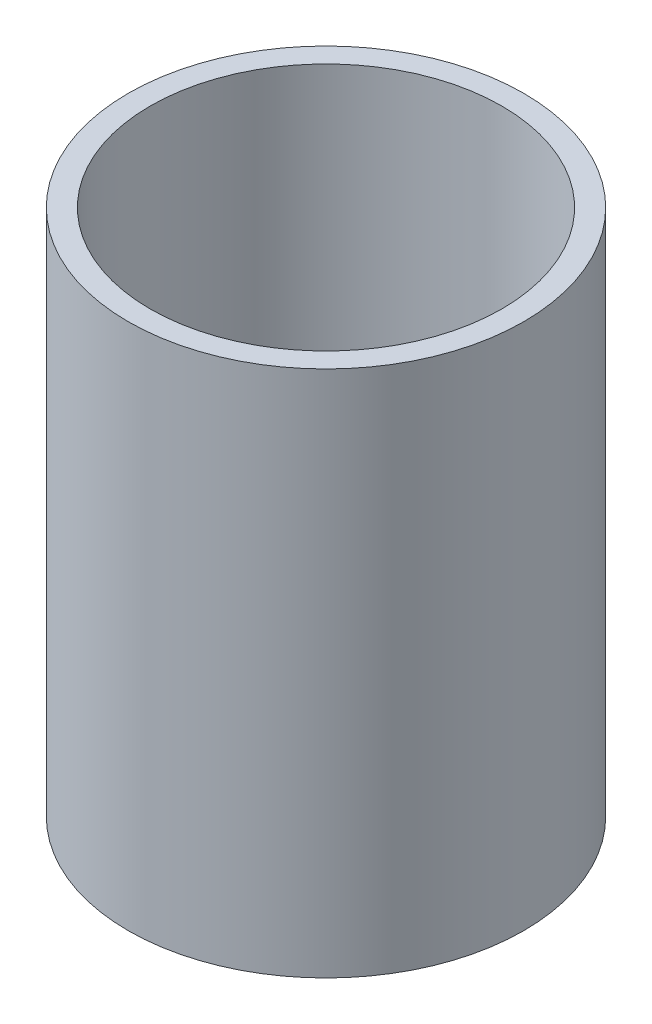
ISO-10303-21;
HEADER;
FILE_DESCRIPTION(('STEP AP214'),'2;1');
FILE_NAME('part.step','',(''),(''),'','','');
FILE_SCHEMA(('AUTOMOTIVE_DESIGN { 1 0 10303 214 1 1 1 1 }'));
ENDSEC;
DATA;
#1=APPLICATION_CONTEXT('core data for automotive mechanical design processes');
#2=APPLICATION_PROTOCOL_DEFINITION('international standard','automotive_design',2000,#1);
#3=PRODUCT_CONTEXT('',#1,'mechanical');
#4=PRODUCT('Part','Part','',(#3));
#5=PRODUCT_RELATED_PRODUCT_CATEGORY('part','',(#4));
#6=PRODUCT_DEFINITION_FORMATION('','',#4);
#7=PRODUCT_DEFINITION_CONTEXT('part definition',#1,'design');
#8=PRODUCT_DEFINITION('design','',#6,#7);
#9=PRODUCT_DEFINITION_SHAPE('','',#8);
#10=(LENGTH_UNIT() NAMED_UNIT(*) SI_UNIT(.MILLI.,.METRE.));
#11=(NAMED_UNIT(*) PLANE_ANGLE_UNIT() SI_UNIT($,.RADIAN.));
#12=(NAMED_UNIT(*) SI_UNIT($,.STERADIAN.) SOLID_ANGLE_UNIT());
#13=UNCERTAINTY_MEASURE_WITH_UNIT(LENGTH_MEASURE(1.E-05),#10,'distance_accuracy_value','');
#14=(GEOMETRIC_REPRESENTATION_CONTEXT(3) GLOBAL_UNCERTAINTY_ASSIGNED_CONTEXT((#13)) GLOBAL_UNIT_ASSIGNED_CONTEXT((#10,
#11,#12)) REPRESENTATION_CONTEXT('',''));
#15=CARTESIAN_POINT('',(0.,0.,0.));
#16=DIRECTION('',(0.,0.,1.));
#17=DIRECTION('',(1.,0.,0.));
#18=AXIS2_PLACEMENT_3D('',#15,#16,#17);
#19=CARTESIAN_POINT('',(75.6325765794573,304.8,71.3570941869266));
#20=DIRECTION('',(0.,1.,0.));
#21=DIRECTION('',(0.,0.,1.));
#22=AXIS2_PLACEMENT_3D('',#19,#20,#21);
#23=PLANE('',#22);
#24=CARTESIAN_POINT('',(75.6325765794573,304.8,71.3570941869266));
#25=DIRECTION('',(0.,1.,0.));
#26=DIRECTION('',(0.,0.,1.));
#27=AXIS2_PLACEMENT_3D('',#24,#25,#26);
#28=CIRCLE('',#27,114.3);
#29=CARTESIAN_POINT('',(75.6325765794573,304.8,185.657094186927));
#30=VERTEX_POINT('',#29);
#31=EDGE_CURVE('E10',#30,#30,#28,.T.);
#32=ORIENTED_EDGE('',*,*,#31,.T.);
#33=EDGE_LOOP('',(#32));
#34=FACE_BOUND('',#33,.T.);
#35=CARTESIAN_POINT('',(75.6325765794573,304.8,71.3570941869266));
#36=DIRECTION('',(0.,1.,0.));
#37=DIRECTION('',(0.,0.,1.));
#38=AXIS2_PLACEMENT_3D('',#35,#36,#37);
#39=CIRCLE('',#38,101.6);
#40=CARTESIAN_POINT('',(75.6325765794573,304.8,172.957094186927));
#41=VERTEX_POINT('',#40);
#42=EDGE_CURVE('E58',#41,#41,#39,.T.);
#43=ORIENTED_EDGE('',*,*,#42,.F.);
#44=EDGE_LOOP('',(#43));
#45=FACE_BOUND('',#44,.T.);
#46=ADVANCED_FACE('F50',(#34,#45),#23,.T.);
#47=CARTESIAN_POINT('',(75.6325765794573,0.,71.3570941869266));
#48=DIRECTION('',(0.,1.,0.));
#49=DIRECTION('',(0.,0.,1.));
#50=AXIS2_PLACEMENT_3D('',#47,#48,#49);
#51=PLANE('',#50);
#52=CARTESIAN_POINT('',(75.6325765794573,0.,71.3570941869266));
#53=DIRECTION('',(0.,1.,0.));
#54=DIRECTION('',(0.,0.,1.));
#55=AXIS2_PLACEMENT_3D('',#52,#53,#54);
#56=CIRCLE('',#55,114.3);
#57=CARTESIAN_POINT('',(75.6325765794573,0.,185.657094186927));
#58=VERTEX_POINT('',#57);
#59=EDGE_CURVE('E51',#58,#58,#56,.T.);
#60=ORIENTED_EDGE('',*,*,#59,.F.);
#61=EDGE_LOOP('',(#60));
#62=FACE_BOUND('',#61,.T.);
#63=CARTESIAN_POINT('',(75.6325765794573,0.,71.3570941869266));
#64=DIRECTION('',(0.,1.,0.));
#65=DIRECTION('',(0.,0.,1.));
#66=AXIS2_PLACEMENT_3D('',#63,#64,#65);
#67=CIRCLE('',#66,101.6);
#68=CARTESIAN_POINT('',(75.6325765794573,0.,172.957094186927));
#69=VERTEX_POINT('',#68);
#70=EDGE_CURVE('E65',#69,#69,#67,.T.);
#71=ORIENTED_EDGE('',*,*,#70,.T.);
#72=EDGE_LOOP('',(#71));
#73=FACE_BOUND('',#72,.T.);
#74=ADVANCED_FACE('F74',(#62,#73),#51,.F.);
#75=CARTESIAN_POINT('',(75.6325765794573,304.8,71.3570941869266));
#76=DIRECTION('',(0.,-1.,0.));
#77=DIRECTION('',(0.,0.,-1.));
#78=AXIS2_PLACEMENT_3D('',#75,#76,#77);
#79=CYLINDRICAL_SURFACE('',#78,114.3);
#80=ORIENTED_EDGE('',*,*,#31,.F.);
#81=EDGE_LOOP('',(#80));
#82=FACE_BOUND('',#81,.T.);
#83=ORIENTED_EDGE('',*,*,#59,.T.);
#84=EDGE_LOOP('',(#83));
#85=FACE_BOUND('',#84,.T.);
#86=ADVANCED_FACE('F47',(#82,#85),#79,.T.);
#87=CARTESIAN_POINT('',(75.6325765794573,304.8,71.3570941869266));
#88=DIRECTION('',(0.,-1.,0.));
#89=DIRECTION('',(0.,0.,-1.));
#90=AXIS2_PLACEMENT_3D('',#87,#88,#89);
#91=CYLINDRICAL_SURFACE('',#90,101.6);
#92=ORIENTED_EDGE('',*,*,#42,.T.);
#93=EDGE_LOOP('',(#92));
#94=FACE_BOUND('',#93,.T.);
#95=ORIENTED_EDGE('',*,*,#70,.F.);
#96=EDGE_LOOP('',(#95));
#97=FACE_BOUND('',#96,.T.);
#98=ADVANCED_FACE('F68',(#94,#97),#91,.F.);
#99=CLOSED_SHELL('',(#46,#74,#86,#98));
#100=MANIFOLD_SOLID_BREP('B2',#99);
#101=ADVANCED_BREP_SHAPE_REPRESENTATION('',(#18,#100),#14);
#102=SHAPE_DEFINITION_REPRESENTATION(#9,#101);
ENDSEC;
END-ISO-10303-21;
